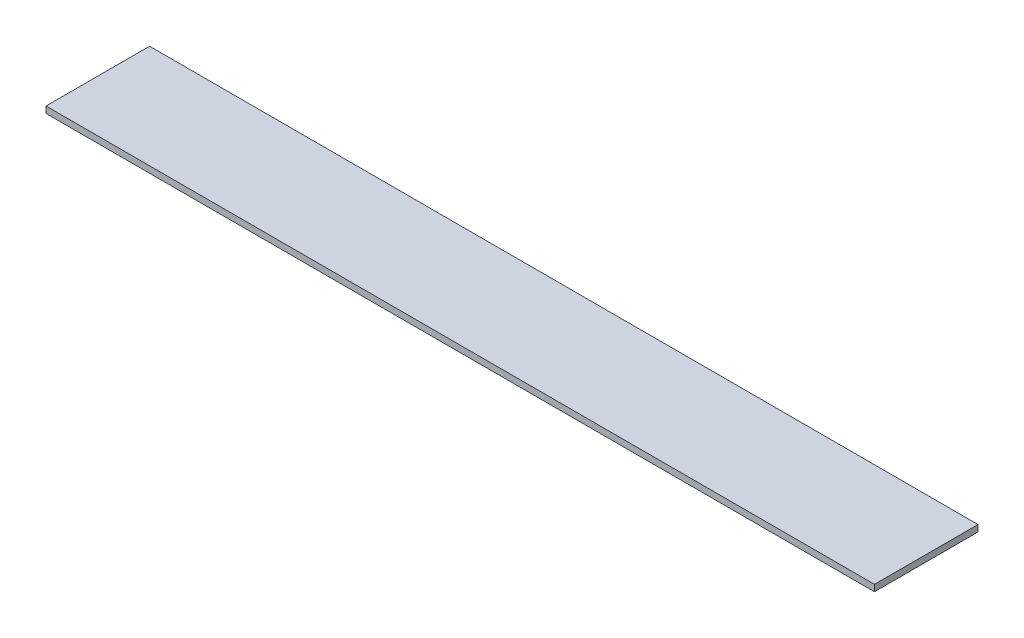
ISO-10303-21;
HEADER;
FILE_DESCRIPTION(('STEP AP214'),'2;1');
FILE_NAME('part.step','',(''),(''),'','','');
FILE_SCHEMA(('AUTOMOTIVE_DESIGN { 1 0 10303 214 1 1 1 1 }'));
ENDSEC;
DATA;
#1=APPLICATION_CONTEXT('core data for automotive mechanical design processes');
#2=APPLICATION_PROTOCOL_DEFINITION('international standard','automotive_design',2000,#1);
#3=PRODUCT_CONTEXT('',#1,'mechanical');
#4=PRODUCT('Part','Part','',(#3));
#5=PRODUCT_RELATED_PRODUCT_CATEGORY('part','',(#4));
#6=PRODUCT_DEFINITION_FORMATION('','',#4);
#7=PRODUCT_DEFINITION_CONTEXT('part definition',#1,'design');
#8=PRODUCT_DEFINITION('design','',#6,#7);
#9=PRODUCT_DEFINITION_SHAPE('','',#8);
#10=(LENGTH_UNIT() NAMED_UNIT(*) SI_UNIT(.MILLI.,.METRE.));
#11=(NAMED_UNIT(*) PLANE_ANGLE_UNIT() SI_UNIT($,.RADIAN.));
#12=(NAMED_UNIT(*) SI_UNIT($,.STERADIAN.) SOLID_ANGLE_UNIT());
#13=UNCERTAINTY_MEASURE_WITH_UNIT(LENGTH_MEASURE(1.E-05),#10,'distance_accuracy_value','');
#14=(GEOMETRIC_REPRESENTATION_CONTEXT(3) GLOBAL_UNCERTAINTY_ASSIGNED_CONTEXT((#13)) GLOBAL_UNIT_ASSIGNED_CONTEXT((#10,
#11,#12)) REPRESENTATION_CONTEXT('',''));
#15=CARTESIAN_POINT('',(0.,0.,0.));
#16=DIRECTION('',(0.,0.,1.));
#17=DIRECTION('',(1.,0.,0.));
#18=AXIS2_PLACEMENT_3D('',#15,#16,#17);
#19=CARTESIAN_POINT('',(-201.810932003878,3.175,-80.2954466140424));
#20=DIRECTION('',(1.,0.,0.));
#21=DIRECTION('',(0.,0.,-1.));
#22=AXIS2_PLACEMENT_3D('',#19,#20,#21);
#23=PLANE('',#22);
#24=DIRECTION('',(0.,0.,1.));
#25=VECTOR('',#24,1.);
#26=CARTESIAN_POINT('',(-201.810932003878,0.,-80.2954466140424));
#27=LINE('',#26,#25);
#28=CARTESIAN_POINT('',(-201.810932003878,0.,-80.2954466140424));
#29=VERTEX_POINT('',#28);
#30=CARTESIAN_POINT('',(-201.810932003878,0.,-29.4954466140424));
#31=VERTEX_POINT('',#30);
#32=EDGE_CURVE('E107',#29,#31,#27,.T.);
#33=ORIENTED_EDGE('',*,*,#32,.T.);
#34=DIRECTION('',(0.,-1.,0.));
#35=VECTOR('',#34,1.);
#36=CARTESIAN_POINT('',(-201.810932003878,3.175,-29.4954466140424));
#37=LINE('',#36,#35);
#38=CARTESIAN_POINT('',(-201.810932003878,3.175,-29.4954466140424));
#39=VERTEX_POINT('',#38);
#40=EDGE_CURVE('E11',#39,#31,#37,.T.);
#41=ORIENTED_EDGE('',*,*,#40,.F.);
#42=DIRECTION('',(0.,0.,1.));
#43=VECTOR('',#42,1.);
#44=CARTESIAN_POINT('',(-201.810932003878,3.175,-80.2954466140424));
#45=LINE('',#44,#43);
#46=CARTESIAN_POINT('',(-201.810932003878,3.175,-80.2954466140424));
#47=VERTEX_POINT('',#46);
#48=EDGE_CURVE('E91',#47,#39,#45,.T.);
#49=ORIENTED_EDGE('',*,*,#48,.F.);
#50=DIRECTION('',(0.,-1.,0.));
#51=VECTOR('',#50,1.);
#52=CARTESIAN_POINT('',(-201.810932003878,3.175,-80.2954466140424));
#53=LINE('',#52,#51);
#54=EDGE_CURVE('E103',#47,#29,#53,.T.);
#55=ORIENTED_EDGE('',*,*,#54,.T.);
#56=EDGE_LOOP('',(#33,#41,#49,#55));
#57=FACE_BOUND('',#56,.T.);
#58=ADVANCED_FACE('F39',(#57),#23,.F.);
#59=CARTESIAN_POINT('',(-201.810932003878,3.175,-29.4954466140424));
#60=DIRECTION('',(0.,0.,-1.));
#61=DIRECTION('',(-1.,0.,0.));
#62=AXIS2_PLACEMENT_3D('',#59,#60,#61);
#63=PLANE('',#62);
#64=DIRECTION('',(1.,0.,0.));
#65=VECTOR('',#64,1.);
#66=CARTESIAN_POINT('',(-201.810932003878,0.,-29.4954466140424));
#67=LINE('',#66,#65);
#68=CARTESIAN_POINT('',(204.589067996122,0.,-29.4954466140424));
#69=VERTEX_POINT('',#68);
#70=EDGE_CURVE('E96',#31,#69,#67,.T.);
#71=ORIENTED_EDGE('',*,*,#70,.T.);
#72=DIRECTION('',(0.,-1.,0.));
#73=VECTOR('',#72,1.);
#74=CARTESIAN_POINT('',(204.589067996122,3.175,-29.4954466140424));
#75=LINE('',#74,#73);
#76=CARTESIAN_POINT('',(204.589067996122,3.175,-29.4954466140424));
#77=VERTEX_POINT('',#76);
#78=EDGE_CURVE('E48',#77,#69,#75,.T.);
#79=ORIENTED_EDGE('',*,*,#78,.F.);
#80=DIRECTION('',(1.,0.,0.));
#81=VECTOR('',#80,1.);
#82=CARTESIAN_POINT('',(-201.810932003878,3.175,-29.4954466140424));
#83=LINE('',#82,#81);
#84=EDGE_CURVE('E86',#39,#77,#83,.T.);
#85=ORIENTED_EDGE('',*,*,#84,.F.);
#86=ORIENTED_EDGE('',*,*,#40,.T.);
#87=EDGE_LOOP('',(#71,#79,#85,#86));
#88=FACE_BOUND('',#87,.T.);
#89=ADVANCED_FACE('F95',(#88),#63,.F.);
#90=CARTESIAN_POINT('',(204.589067996122,3.175,-80.2954466140424));
#91=DIRECTION('',(-1.,0.,0.));
#92=DIRECTION('',(0.,0.,1.));
#93=AXIS2_PLACEMENT_3D('',#90,#91,#92);
#94=PLANE('',#93);
#95=DIRECTION('',(0.,0.,-1.));
#96=VECTOR('',#95,1.);
#97=CARTESIAN_POINT('',(204.589067996122,0.,-80.2954466140424));
#98=LINE('',#97,#96);
#99=CARTESIAN_POINT('',(204.589067996122,0.,-80.2954466140424));
#100=VERTEX_POINT('',#99);
#101=EDGE_CURVE('E73',#69,#100,#98,.T.);
#102=ORIENTED_EDGE('',*,*,#101,.T.);
#103=DIRECTION('',(0.,-1.,0.));
#104=VECTOR('',#103,1.);
#105=CARTESIAN_POINT('',(204.589067996122,3.175,-80.2954466140424));
#106=LINE('',#105,#104);
#107=CARTESIAN_POINT('',(204.589067996122,3.175,-80.2954466140424));
#108=VERTEX_POINT('',#107);
#109=EDGE_CURVE('E98',#108,#100,#106,.T.);
#110=ORIENTED_EDGE('',*,*,#109,.F.);
#111=DIRECTION('',(0.,0.,-1.));
#112=VECTOR('',#111,1.);
#113=CARTESIAN_POINT('',(204.589067996122,3.175,-80.2954466140424));
#114=LINE('',#113,#112);
#115=EDGE_CURVE('E89',#77,#108,#114,.T.);
#116=ORIENTED_EDGE('',*,*,#115,.F.);
#117=ORIENTED_EDGE('',*,*,#78,.T.);
#118=EDGE_LOOP('',(#102,#110,#116,#117));
#119=FACE_BOUND('',#118,.T.);
#120=ADVANCED_FACE('F99',(#119),#94,.F.);
#121=CARTESIAN_POINT('',(-201.810932003878,3.175,-80.2954466140424));
#122=DIRECTION('',(0.,0.,1.));
#123=DIRECTION('',(1.,0.,0.));
#124=AXIS2_PLACEMENT_3D('',#121,#122,#123);
#125=PLANE('',#124);
#126=DIRECTION('',(-1.,0.,0.));
#127=VECTOR('',#126,1.);
#128=CARTESIAN_POINT('',(-201.810932003878,0.,-80.2954466140424));
#129=LINE('',#128,#127);
#130=EDGE_CURVE('E79',#100,#29,#129,.T.);
#131=ORIENTED_EDGE('',*,*,#130,.T.);
#132=ORIENTED_EDGE('',*,*,#54,.F.);
#133=DIRECTION('',(-1.,0.,0.));
#134=VECTOR('',#133,1.);
#135=CARTESIAN_POINT('',(-201.810932003878,3.175,-80.2954466140424));
#136=LINE('',#135,#134);
#137=EDGE_CURVE('E56',#108,#47,#136,.T.);
#138=ORIENTED_EDGE('',*,*,#137,.F.);
#139=ORIENTED_EDGE('',*,*,#109,.T.);
#140=EDGE_LOOP('',(#131,#132,#138,#139));
#141=FACE_BOUND('',#140,.T.);
#142=ADVANCED_FACE('F120',(#141),#125,.F.);
#143=CARTESIAN_POINT('',(0.,3.175,0.));
#144=DIRECTION('',(0.,1.,0.));
#145=DIRECTION('',(0.,0.,1.));
#146=AXIS2_PLACEMENT_3D('',#143,#144,#145);
#147=PLANE('',#146);
#148=ORIENTED_EDGE('',*,*,#48,.T.);
#149=ORIENTED_EDGE('',*,*,#84,.T.);
#150=ORIENTED_EDGE('',*,*,#115,.T.);
#151=ORIENTED_EDGE('',*,*,#137,.T.);
#152=EDGE_LOOP('',(#148,#149,#150,#151));
#153=FACE_BOUND('',#152,.T.);
#154=ADVANCED_FACE('F87',(#153),#147,.T.);
#155=CARTESIAN_POINT('',(0.,0.,0.));
#156=DIRECTION('',(0.,1.,0.));
#157=DIRECTION('',(0.,0.,1.));
#158=AXIS2_PLACEMENT_3D('',#155,#156,#157);
#159=PLANE('',#158);
#160=ORIENTED_EDGE('',*,*,#32,.F.);
#161=ORIENTED_EDGE('',*,*,#130,.F.);
#162=ORIENTED_EDGE('',*,*,#101,.F.);
#163=ORIENTED_EDGE('',*,*,#70,.F.);
#164=EDGE_LOOP('',(#160,#161,#162,#163));
#165=FACE_BOUND('',#164,.T.);
#166=ADVANCED_FACE('F123',(#165),#159,.F.);
#167=CLOSED_SHELL('',(#58,#89,#120,#142,#154,#166));
#168=MANIFOLD_SOLID_BREP('B2',#167);
#169=ADVANCED_BREP_SHAPE_REPRESENTATION('',(#18,#168),#14);
#170=SHAPE_DEFINITION_REPRESENTATION(#9,#169);
ENDSEC;
END-ISO-10303-21;
